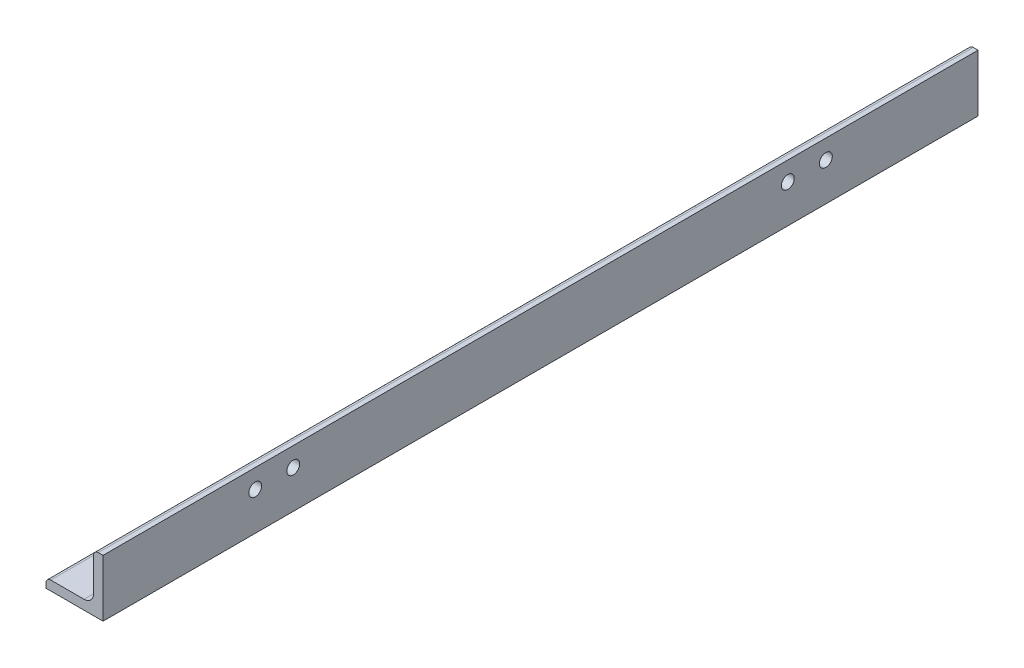
ISO-10303-21;
HEADER;
FILE_DESCRIPTION(('STEP AP214'),'2;1');
FILE_NAME('part.step','',(''),(''),'','','');
FILE_SCHEMA(('AUTOMOTIVE_DESIGN { 1 0 10303 214 1 1 1 1 }'));
ENDSEC;
DATA;
#1=APPLICATION_CONTEXT('core data for automotive mechanical design processes');
#2=APPLICATION_PROTOCOL_DEFINITION('international standard','automotive_design',2000,#1);
#3=PRODUCT_CONTEXT('',#1,'mechanical');
#4=PRODUCT('Part','Part','',(#3));
#5=PRODUCT_RELATED_PRODUCT_CATEGORY('part','',(#4));
#6=PRODUCT_DEFINITION_FORMATION('','',#4);
#7=PRODUCT_DEFINITION_CONTEXT('part definition',#1,'design');
#8=PRODUCT_DEFINITION('design','',#6,#7);
#9=PRODUCT_DEFINITION_SHAPE('','',#8);
#10=(LENGTH_UNIT() NAMED_UNIT(*) SI_UNIT(.MILLI.,.METRE.));
#11=(NAMED_UNIT(*) PLANE_ANGLE_UNIT() SI_UNIT($,.RADIAN.));
#12=(NAMED_UNIT(*) SI_UNIT($,.STERADIAN.) SOLID_ANGLE_UNIT());
#13=UNCERTAINTY_MEASURE_WITH_UNIT(LENGTH_MEASURE(1.E-05),#10,'distance_accuracy_value','');
#14=(GEOMETRIC_REPRESENTATION_CONTEXT(3) GLOBAL_UNCERTAINTY_ASSIGNED_CONTEXT((#13)) GLOBAL_UNIT_ASSIGNED_CONTEXT((#10,
#11,#12)) REPRESENTATION_CONTEXT('',''));
#15=CARTESIAN_POINT('',(0.,0.,0.));
#16=DIRECTION('',(0.,0.,1.));
#17=DIRECTION('',(1.,0.,0.));
#18=AXIS2_PLACEMENT_3D('',#15,#16,#17);
#19=CARTESIAN_POINT('',(3.17500000000001,-6.35,146.05));
#20=DIRECTION('',(0.,-1.,0.));
#21=DIRECTION('',(1.,0.,0.));
#22=AXIS2_PLACEMENT_3D('',#19,#20,#21);
#23=PLANE('',#22);
#24=CARTESIAN_POINT('',(-3.175,-6.35,-82.55));
#25=DIRECTION('',(0.,1.,0.));
#26=DIRECTION('',(0.,0.,1.));
#27=AXIS2_PLACEMENT_3D('',#24,#25,#26);
#28=CIRCLE('',#27,2.15264999999999);
#29=CARTESIAN_POINT('',(-3.175,-6.35,-80.39735));
#30=VERTEX_POINT('',#29);
#31=EDGE_CURVE('E228',#30,#30,#28,.T.);
#32=ORIENTED_EDGE('',*,*,#31,.F.);
#33=EDGE_LOOP('',(#32));
#34=FACE_BOUND('',#33,.T.);
#35=CARTESIAN_POINT('',(-3.17500000000001,-6.35,-95.25));
#36=DIRECTION('',(0.,1.,0.));
#37=DIRECTION('',(0.,0.,1.));
#38=AXIS2_PLACEMENT_3D('',#35,#36,#37);
#39=CIRCLE('',#38,2.15264999999999);
#40=CARTESIAN_POINT('',(-3.17500000000001,-6.35,-93.09735));
#41=VERTEX_POINT('',#40);
#42=EDGE_CURVE('E234',#41,#41,#39,.T.);
#43=ORIENTED_EDGE('',*,*,#42,.F.);
#44=EDGE_LOOP('',(#43));
#45=FACE_BOUND('',#44,.T.);
#46=CARTESIAN_POINT('',(-3.175,-6.35,82.55));
#47=DIRECTION('',(0.,1.,0.));
#48=DIRECTION('',(0.,0.,1.));
#49=AXIS2_PLACEMENT_3D('',#46,#47,#48);
#50=CIRCLE('',#49,2.15264999999999);
#51=CARTESIAN_POINT('',(-3.175,-6.35,84.70265));
#52=VERTEX_POINT('',#51);
#53=EDGE_CURVE('E240',#52,#52,#50,.T.);
#54=ORIENTED_EDGE('',*,*,#53,.F.);
#55=EDGE_LOOP('',(#54));
#56=FACE_BOUND('',#55,.T.);
#57=CARTESIAN_POINT('',(-3.17500000000001,-6.35,95.25));
#58=DIRECTION('',(0.,1.,0.));
#59=DIRECTION('',(0.,0.,1.));
#60=AXIS2_PLACEMENT_3D('',#57,#58,#59);
#61=CIRCLE('',#60,2.15264999999999);
#62=CARTESIAN_POINT('',(-3.17500000000001,-6.35,97.40265));
#63=VERTEX_POINT('',#62);
#64=EDGE_CURVE('E246',#63,#63,#61,.T.);
#65=ORIENTED_EDGE('',*,*,#64,.F.);
#66=EDGE_LOOP('',(#65));
#67=FACE_BOUND('',#66,.T.);
#68=CARTESIAN_POINT('',(1.58750000000001,-6.34999999999999,-134.9375));
#69=DIRECTION('',(0.,1.,0.));
#70=DIRECTION('',(0.,0.,1.));
#71=AXIS2_PLACEMENT_3D('',#68,#69,#70);
#72=CIRCLE('',#71,2.15264999999999);
#73=CARTESIAN_POINT('',(3.17500000000001,-6.35,-136.39137268098));
#74=VERTEX_POINT('',#73);
#75=CARTESIAN_POINT('',(3.17500000000001,-6.34999999999999,-133.48362731902));
#76=VERTEX_POINT('',#75);
#77=EDGE_CURVE('E264',#74,#76,#72,.T.);
#78=ORIENTED_EDGE('',*,*,#77,.F.);
#79=DIRECTION('',(0.,0.,-1.));
#80=VECTOR('',#79,1.);
#81=CARTESIAN_POINT('',(3.17500000000001,-6.35,146.05));
#82=LINE('',#81,#80);
#83=CARTESIAN_POINT('',(3.17500000000001,-6.35,-146.05));
#84=VERTEX_POINT('',#83);
#85=EDGE_CURVE('E147',#74,#84,#82,.T.);
#86=ORIENTED_EDGE('',*,*,#85,.T.);
#87=DIRECTION('',(-1.,0.,0.));
#88=VECTOR('',#87,1.);
#89=CARTESIAN_POINT('',(3.17500000000001,-6.35,-146.05));
#90=LINE('',#89,#88);
#91=CARTESIAN_POINT('',(-7.9375,-6.35,-146.05));
#92=VERTEX_POINT('',#91);
#93=EDGE_CURVE('E170',#84,#92,#90,.T.);
#94=ORIENTED_EDGE('',*,*,#93,.T.);
#95=DIRECTION('',(0.,0.,-1.));
#96=VECTOR('',#95,1.);
#97=CARTESIAN_POINT('',(-7.9375,-6.35,146.05));
#98=LINE('',#97,#96);
#99=CARTESIAN_POINT('',(-7.9375,-6.35,146.05));
#100=VERTEX_POINT('',#99);
#101=EDGE_CURVE('E148',#100,#92,#98,.T.);
#102=ORIENTED_EDGE('',*,*,#101,.F.);
#103=DIRECTION('',(-1.,0.,0.));
#104=VECTOR('',#103,1.);
#105=CARTESIAN_POINT('',(3.17500000000001,-6.35,146.05));
#106=LINE('',#105,#104);
#107=CARTESIAN_POINT('',(3.17500000000001,-6.35,146.05));
#108=VERTEX_POINT('',#107);
#109=EDGE_CURVE('E128',#108,#100,#106,.T.);
#110=ORIENTED_EDGE('',*,*,#109,.F.);
#111=EDGE_CURVE('E138',#108,#76,#82,.T.);
#112=ORIENTED_EDGE('',*,*,#111,.T.);
#113=EDGE_LOOP('',(#78,#86,#94,#102,#110,#112));
#114=FACE_BOUND('',#113,.T.);
#115=ADVANCED_FACE('F40',(#34,#45,#56,#67,#114),#23,.F.);
#116=CARTESIAN_POINT('',(-9.525,-7.9375,146.05));
#117=DIRECTION('',(1.,0.,0.));
#118=DIRECTION('',(0.,0.,-1.));
#119=AXIS2_PLACEMENT_3D('',#116,#117,#118);
#120=PLANE('',#119);
#121=DIRECTION('',(0.,-1.,0.));
#122=VECTOR('',#121,1.);
#123=CARTESIAN_POINT('',(-9.525,-7.9375,-146.05));
#124=LINE('',#123,#122);
#125=CARTESIAN_POINT('',(-9.525,-7.9375,-146.05));
#126=VERTEX_POINT('',#125);
#127=CARTESIAN_POINT('',(-9.525,-9.525,-146.05));
#128=VERTEX_POINT('',#127);
#129=EDGE_CURVE('E154',#126,#128,#124,.T.);
#130=ORIENTED_EDGE('',*,*,#129,.T.);
#131=DIRECTION('',(0.,0.,-1.));
#132=VECTOR('',#131,1.);
#133=CARTESIAN_POINT('',(-9.525,-9.525,146.05));
#134=LINE('',#133,#132);
#135=CARTESIAN_POINT('',(-9.525,-9.525,146.05));
#136=VERTEX_POINT('',#135);
#137=EDGE_CURVE('E11',#136,#128,#134,.T.);
#138=ORIENTED_EDGE('',*,*,#137,.F.);
#139=DIRECTION('',(0.,-1.,0.));
#140=VECTOR('',#139,1.);
#141=CARTESIAN_POINT('',(-9.525,-7.9375,146.05));
#142=LINE('',#141,#140);
#143=CARTESIAN_POINT('',(-9.525,-7.9375,146.05));
#144=VERTEX_POINT('',#143);
#145=EDGE_CURVE('E173',#144,#136,#142,.T.);
#146=ORIENTED_EDGE('',*,*,#145,.F.);
#147=DIRECTION('',(0.,0.,-1.));
#148=VECTOR('',#147,1.);
#149=CARTESIAN_POINT('',(-9.525,-7.9375,146.05));
#150=LINE('',#149,#148);
#151=EDGE_CURVE('E150',#144,#126,#150,.T.);
#152=ORIENTED_EDGE('',*,*,#151,.T.);
#153=EDGE_LOOP('',(#130,#138,#146,#152));
#154=FACE_BOUND('',#153,.T.);
#155=ADVANCED_FACE('F42',(#154),#120,.F.);
#156=CARTESIAN_POINT('',(-9.525,-9.525,146.05));
#157=DIRECTION('',(0.,1.,0.));
#158=DIRECTION('',(-1.,0.,0.));
#159=AXIS2_PLACEMENT_3D('',#156,#157,#158);
#160=PLANE('',#159);
#161=CARTESIAN_POINT('',(1.58750000000001,-9.52500000000001,-134.9375));
#162=DIRECTION('',(0.,1.,0.));
#163=DIRECTION('',(0.,0.,1.));
#164=AXIS2_PLACEMENT_3D('',#161,#162,#163);
#165=CIRCLE('',#164,2.15264999999999);
#166=CARTESIAN_POINT('',(1.58750000000001,-9.52500000000001,-132.78485));
#167=VERTEX_POINT('',#166);
#168=EDGE_CURVE('E261',#167,#167,#165,.T.);
#169=ORIENTED_EDGE('',*,*,#168,.T.);
#170=EDGE_LOOP('',(#169));
#171=FACE_BOUND('',#170,.T.);
#172=CARTESIAN_POINT('',(-3.17500000000001,-9.525,95.25));
#173=DIRECTION('',(0.,1.,0.));
#174=DIRECTION('',(0.,0.,1.));
#175=AXIS2_PLACEMENT_3D('',#172,#173,#174);
#176=CIRCLE('',#175,2.15265);
#177=CARTESIAN_POINT('',(-3.17500000000001,-9.525,97.40265));
#178=VERTEX_POINT('',#177);
#179=EDGE_CURVE('E243',#178,#178,#176,.T.);
#180=ORIENTED_EDGE('',*,*,#179,.T.);
#181=EDGE_LOOP('',(#180));
#182=FACE_BOUND('',#181,.T.);
#183=CARTESIAN_POINT('',(-3.175,-9.525,82.55));
#184=DIRECTION('',(0.,1.,0.));
#185=DIRECTION('',(0.,0.,1.));
#186=AXIS2_PLACEMENT_3D('',#183,#184,#185);
#187=CIRCLE('',#186,2.15265);
#188=CARTESIAN_POINT('',(-3.175,-9.525,84.70265));
#189=VERTEX_POINT('',#188);
#190=EDGE_CURVE('E237',#189,#189,#187,.T.);
#191=ORIENTED_EDGE('',*,*,#190,.T.);
#192=EDGE_LOOP('',(#191));
#193=FACE_BOUND('',#192,.T.);
#194=CARTESIAN_POINT('',(-3.17500000000001,-9.525,-95.25));
#195=DIRECTION('',(0.,1.,0.));
#196=DIRECTION('',(0.,0.,1.));
#197=AXIS2_PLACEMENT_3D('',#194,#195,#196);
#198=CIRCLE('',#197,2.15265);
#199=CARTESIAN_POINT('',(-3.17500000000001,-9.525,-93.09735));
#200=VERTEX_POINT('',#199);
#201=EDGE_CURVE('E231',#200,#200,#198,.T.);
#202=ORIENTED_EDGE('',*,*,#201,.T.);
#203=EDGE_LOOP('',(#202));
#204=FACE_BOUND('',#203,.T.);
#205=CARTESIAN_POINT('',(-3.175,-9.525,-82.55));
#206=DIRECTION('',(0.,1.,0.));
#207=DIRECTION('',(0.,0.,1.));
#208=AXIS2_PLACEMENT_3D('',#205,#206,#207);
#209=CIRCLE('',#208,2.15265);
#210=CARTESIAN_POINT('',(-3.175,-9.525,-80.39735));
#211=VERTEX_POINT('',#210);
#212=EDGE_CURVE('E225',#211,#211,#209,.T.);
#213=ORIENTED_EDGE('',*,*,#212,.T.);
#214=EDGE_LOOP('',(#213));
#215=FACE_BOUND('',#214,.T.);
#216=DIRECTION('',(1.,0.,0.));
#217=VECTOR('',#216,1.);
#218=CARTESIAN_POINT('',(-9.525,-9.525,-146.05));
#219=LINE('',#218,#217);
#220=CARTESIAN_POINT('',(9.525,-9.525,-146.05));
#221=VERTEX_POINT('',#220);
#222=EDGE_CURVE('E157',#128,#221,#219,.T.);
#223=ORIENTED_EDGE('',*,*,#222,.T.);
#224=DIRECTION('',(0.,0.,-1.));
#225=VECTOR('',#224,1.);
#226=CARTESIAN_POINT('',(9.525,-9.525,146.05));
#227=LINE('',#226,#225);
#228=CARTESIAN_POINT('',(9.525,-9.525,146.05));
#229=VERTEX_POINT('',#228);
#230=EDGE_CURVE('E48',#229,#221,#227,.T.);
#231=ORIENTED_EDGE('',*,*,#230,.F.);
#232=DIRECTION('',(1.,0.,0.));
#233=VECTOR('',#232,1.);
#234=CARTESIAN_POINT('',(-9.525,-9.525,146.05));
#235=LINE('',#234,#233);
#236=EDGE_CURVE('E107',#136,#229,#235,.T.);
#237=ORIENTED_EDGE('',*,*,#236,.F.);
#238=ORIENTED_EDGE('',*,*,#137,.T.);
#239=EDGE_LOOP('',(#223,#231,#237,#238));
#240=FACE_BOUND('',#239,.T.);
#241=ADVANCED_FACE('F293',(#171,#182,#193,#204,#215,#240),#160,.F.);
#242=CARTESIAN_POINT('',(9.525,-9.525,146.05));
#243=DIRECTION('',(-1.,0.,0.));
#244=DIRECTION('',(0.,-1.,0.));
#245=AXIS2_PLACEMENT_3D('',#242,#243,#244);
#246=PLANE('',#245);
#247=CARTESIAN_POINT('',(9.525,3.175,95.25));
#248=DIRECTION('',(-1.,0.,0.));
#249=DIRECTION('',(0.,0.,1.));
#250=AXIS2_PLACEMENT_3D('',#247,#248,#249);
#251=CIRCLE('',#250,2.15265);
#252=CARTESIAN_POINT('',(9.525,3.175,97.40265));
#253=VERTEX_POINT('',#252);
#254=EDGE_CURVE('E255',#253,#253,#251,.T.);
#255=ORIENTED_EDGE('',*,*,#254,.T.);
#256=EDGE_LOOP('',(#255));
#257=FACE_BOUND('',#256,.T.);
#258=CARTESIAN_POINT('',(9.525,3.175,82.55));
#259=DIRECTION('',(-1.,0.,0.));
#260=DIRECTION('',(0.,0.,1.));
#261=AXIS2_PLACEMENT_3D('',#258,#259,#260);
#262=CIRCLE('',#261,2.15265);
#263=CARTESIAN_POINT('',(9.525,3.175,84.70265));
#264=VERTEX_POINT('',#263);
#265=EDGE_CURVE('E249',#264,#264,#262,.T.);
#266=ORIENTED_EDGE('',*,*,#265,.T.);
#267=EDGE_LOOP('',(#266));
#268=FACE_BOUND('',#267,.T.);
#269=CARTESIAN_POINT('',(9.525,3.175,-95.25));
#270=DIRECTION('',(-1.,0.,0.));
#271=DIRECTION('',(0.,0.,1.));
#272=AXIS2_PLACEMENT_3D('',#269,#270,#271);
#273=CIRCLE('',#272,2.15265);
#274=CARTESIAN_POINT('',(9.525,3.175,-93.09735));
#275=VERTEX_POINT('',#274);
#276=EDGE_CURVE('E219',#275,#275,#273,.T.);
#277=ORIENTED_EDGE('',*,*,#276,.T.);
#278=EDGE_LOOP('',(#277));
#279=FACE_BOUND('',#278,.T.);
#280=CARTESIAN_POINT('',(9.525,3.175,-82.55));
#281=DIRECTION('',(-1.,0.,0.));
#282=DIRECTION('',(0.,0.,1.));
#283=AXIS2_PLACEMENT_3D('',#280,#281,#282);
#284=CIRCLE('',#283,2.15265);
#285=CARTESIAN_POINT('',(9.525,3.175,-80.39735));
#286=VERTEX_POINT('',#285);
#287=EDGE_CURVE('E158',#286,#286,#284,.T.);
#288=ORIENTED_EDGE('',*,*,#287,.T.);
#289=EDGE_LOOP('',(#288));
#290=FACE_BOUND('',#289,.T.);
#291=DIRECTION('',(0.,1.,0.));
#292=VECTOR('',#291,1.);
#293=CARTESIAN_POINT('',(9.525,-9.525,-146.05));
#294=LINE('',#293,#292);
#295=CARTESIAN_POINT('',(9.525,9.525,-146.05));
#296=VERTEX_POINT('',#295);
#297=EDGE_CURVE('E160',#221,#296,#294,.T.);
#298=ORIENTED_EDGE('',*,*,#297,.T.);
#299=DIRECTION('',(0.,0.,-1.));
#300=VECTOR('',#299,1.);
#301=CARTESIAN_POINT('',(9.525,9.525,146.05));
#302=LINE('',#301,#300);
#303=CARTESIAN_POINT('',(9.525,9.525,146.05));
#304=VERTEX_POINT('',#303);
#305=EDGE_CURVE('E183',#304,#296,#302,.T.);
#306=ORIENTED_EDGE('',*,*,#305,.F.);
#307=DIRECTION('',(0.,1.,0.));
#308=VECTOR('',#307,1.);
#309=CARTESIAN_POINT('',(9.525,-9.525,146.05));
#310=LINE('',#309,#308);
#311=EDGE_CURVE('E191',#229,#304,#310,.T.);
#312=ORIENTED_EDGE('',*,*,#311,.F.);
#313=ORIENTED_EDGE('',*,*,#230,.T.);
#314=EDGE_LOOP('',(#298,#306,#312,#313));
#315=FACE_BOUND('',#314,.T.);
#316=ADVANCED_FACE('F189',(#257,#268,#279,#290,#315),#246,.F.);
#317=CARTESIAN_POINT('',(7.9375,9.525,146.05));
#318=DIRECTION('',(0.,-1.,0.));
#319=DIRECTION('',(1.,0.,0.));
#320=AXIS2_PLACEMENT_3D('',#317,#318,#319);
#321=PLANE('',#320);
#322=DIRECTION('',(-1.,0.,0.));
#323=VECTOR('',#322,1.);
#324=CARTESIAN_POINT('',(7.9375,9.525,-146.05));
#325=LINE('',#324,#323);
#326=CARTESIAN_POINT('',(7.9375,9.525,-146.05));
#327=VERTEX_POINT('',#326);
#328=EDGE_CURVE('E162',#296,#327,#325,.T.);
#329=ORIENTED_EDGE('',*,*,#328,.T.);
#330=DIRECTION('',(0.,0.,-1.));
#331=VECTOR('',#330,1.);
#332=CARTESIAN_POINT('',(7.9375,9.525,146.05));
#333=LINE('',#332,#331);
#334=CARTESIAN_POINT('',(7.9375,9.525,146.05));
#335=VERTEX_POINT('',#334);
#336=EDGE_CURVE('E180',#335,#327,#333,.T.);
#337=ORIENTED_EDGE('',*,*,#336,.F.);
#338=DIRECTION('',(-1.,0.,0.));
#339=VECTOR('',#338,1.);
#340=CARTESIAN_POINT('',(7.9375,9.525,146.05));
#341=LINE('',#340,#339);
#342=EDGE_CURVE('E207',#304,#335,#341,.T.);
#343=ORIENTED_EDGE('',*,*,#342,.F.);
#344=ORIENTED_EDGE('',*,*,#305,.T.);
#345=EDGE_LOOP('',(#329,#337,#343,#344));
#346=FACE_BOUND('',#345,.T.);
#347=ADVANCED_FACE('F200',(#346),#321,.F.);
#348=CARTESIAN_POINT('',(7.9375,7.9375,146.05));
#349=DIRECTION('',(0.,0.,-1.));
#350=DIRECTION('',(-1.,0.,0.));
#351=AXIS2_PLACEMENT_3D('',#348,#349,#350);
#352=CYLINDRICAL_SURFACE('',#351,1.5875);
#353=CARTESIAN_POINT('',(7.9375,7.9375,-146.05));
#354=DIRECTION('',(0.,0.,1.));
#355=DIRECTION('',(-1.,0.,0.));
#356=AXIS2_PLACEMENT_3D('',#353,#354,#355);
#357=CIRCLE('',#356,1.5875);
#358=CARTESIAN_POINT('',(6.35,7.9375,-146.05));
#359=VERTEX_POINT('',#358);
#360=EDGE_CURVE('E164',#327,#359,#357,.T.);
#361=ORIENTED_EDGE('',*,*,#360,.T.);
#362=DIRECTION('',(0.,0.,-1.));
#363=VECTOR('',#362,1.);
#364=CARTESIAN_POINT('',(6.35,7.9375,146.05));
#365=LINE('',#364,#363);
#366=CARTESIAN_POINT('',(6.35,7.9375,146.05));
#367=VERTEX_POINT('',#366);
#368=EDGE_CURVE('E177',#367,#359,#365,.T.);
#369=ORIENTED_EDGE('',*,*,#368,.F.);
#370=CARTESIAN_POINT('',(7.9375,7.9375,146.05));
#371=DIRECTION('',(0.,0.,1.));
#372=DIRECTION('',(-1.,0.,0.));
#373=AXIS2_PLACEMENT_3D('',#370,#371,#372);
#374=CIRCLE('',#373,1.5875);
#375=EDGE_CURVE('E206',#335,#367,#374,.T.);
#376=ORIENTED_EDGE('',*,*,#375,.F.);
#377=ORIENTED_EDGE('',*,*,#336,.T.);
#378=EDGE_LOOP('',(#361,#369,#376,#377));
#379=FACE_BOUND('',#378,.T.);
#380=ADVANCED_FACE('F204',(#379),#352,.T.);
#381=CARTESIAN_POINT('',(6.35,7.9375,146.05));
#382=DIRECTION('',(1.,0.,0.));
#383=DIRECTION('',(0.,1.,0.));
#384=AXIS2_PLACEMENT_3D('',#381,#382,#383);
#385=PLANE('',#384);
#386=CARTESIAN_POINT('',(6.35,3.175,95.25));
#387=DIRECTION('',(-1.,0.,0.));
#388=DIRECTION('',(0.,0.,1.));
#389=AXIS2_PLACEMENT_3D('',#386,#387,#388);
#390=CIRCLE('',#389,2.15264999999999);
#391=CARTESIAN_POINT('',(6.35,3.175,97.40265));
#392=VERTEX_POINT('',#391);
#393=EDGE_CURVE('E258',#392,#392,#390,.T.);
#394=ORIENTED_EDGE('',*,*,#393,.F.);
#395=EDGE_LOOP('',(#394));
#396=FACE_BOUND('',#395,.T.);
#397=CARTESIAN_POINT('',(6.35,3.175,82.55));
#398=DIRECTION('',(-1.,0.,0.));
#399=DIRECTION('',(0.,0.,1.));
#400=AXIS2_PLACEMENT_3D('',#397,#398,#399);
#401=CIRCLE('',#400,2.15264999999999);
#402=CARTESIAN_POINT('',(6.35,3.175,84.70265));
#403=VERTEX_POINT('',#402);
#404=EDGE_CURVE('E252',#403,#403,#401,.T.);
#405=ORIENTED_EDGE('',*,*,#404,.F.);
#406=EDGE_LOOP('',(#405));
#407=FACE_BOUND('',#406,.T.);
#408=CARTESIAN_POINT('',(6.35,3.175,-95.25));
#409=DIRECTION('',(-1.,0.,0.));
#410=DIRECTION('',(0.,0.,1.));
#411=AXIS2_PLACEMENT_3D('',#408,#409,#410);
#412=CIRCLE('',#411,2.15264999999999);
#413=CARTESIAN_POINT('',(6.35,3.175,-93.09735));
#414=VERTEX_POINT('',#413);
#415=EDGE_CURVE('E222',#414,#414,#412,.T.);
#416=ORIENTED_EDGE('',*,*,#415,.F.);
#417=EDGE_LOOP('',(#416));
#418=FACE_BOUND('',#417,.T.);
#419=CARTESIAN_POINT('',(6.35,3.175,-82.55));
#420=DIRECTION('',(-1.,0.,0.));
#421=DIRECTION('',(0.,0.,1.));
#422=AXIS2_PLACEMENT_3D('',#419,#420,#421);
#423=CIRCLE('',#422,2.15264999999999);
#424=CARTESIAN_POINT('',(6.35,3.175,-80.39735));
#425=VERTEX_POINT('',#424);
#426=EDGE_CURVE('E216',#425,#425,#423,.T.);
#427=ORIENTED_EDGE('',*,*,#426,.F.);
#428=EDGE_LOOP('',(#427));
#429=FACE_BOUND('',#428,.T.);
#430=DIRECTION('',(0.,-1.,0.));
#431=VECTOR('',#430,1.);
#432=CARTESIAN_POINT('',(6.35,7.9375,-146.05));
#433=LINE('',#432,#431);
#434=CARTESIAN_POINT('',(6.35,-3.175,-146.05));
#435=VERTEX_POINT('',#434);
#436=EDGE_CURVE('E166',#359,#435,#433,.T.);
#437=ORIENTED_EDGE('',*,*,#436,.T.);
#438=DIRECTION('',(0.,0.,-1.));
#439=VECTOR('',#438,1.);
#440=CARTESIAN_POINT('',(6.35,-3.175,146.05));
#441=LINE('',#440,#439);
#442=CARTESIAN_POINT('',(6.35,-3.175,146.05));
#443=VERTEX_POINT('',#442);
#444=EDGE_CURVE('E145',#443,#435,#441,.T.);
#445=ORIENTED_EDGE('',*,*,#444,.F.);
#446=DIRECTION('',(0.,-1.,0.));
#447=VECTOR('',#446,1.);
#448=CARTESIAN_POINT('',(6.35,7.9375,146.05));
#449=LINE('',#448,#447);
#450=EDGE_CURVE('E131',#367,#443,#449,.T.);
#451=ORIENTED_EDGE('',*,*,#450,.F.);
#452=ORIENTED_EDGE('',*,*,#368,.T.);
#453=EDGE_LOOP('',(#437,#445,#451,#452));
#454=FACE_BOUND('',#453,.T.);
#455=ADVANCED_FACE('F282',(#396,#407,#418,#429,#454),#385,.F.);
#456=CARTESIAN_POINT('',(3.17500000000001,-3.175,146.05));
#457=DIRECTION('',(0.,0.,-1.));
#458=DIRECTION('',(-1.,0.,0.));
#459=AXIS2_PLACEMENT_3D('',#456,#457,#458);
#460=CYLINDRICAL_SURFACE('',#459,3.175);
#461=CARTESIAN_POINT('',(3.17500000000001,-3.175,-146.05));
#462=DIRECTION('',(0.,0.,-1.));
#463=DIRECTION('',(-1.,0.,0.));
#464=AXIS2_PLACEMENT_3D('',#461,#462,#463);
#465=CIRCLE('',#464,3.175);
#466=EDGE_CURVE('E168',#435,#84,#465,.T.);
#467=ORIENTED_EDGE('',*,*,#466,.T.);
#468=ORIENTED_EDGE('',*,*,#85,.F.);
#469=EDGE_CURVE('E142',#76,#74,#82,.T.);
#470=ORIENTED_EDGE('',*,*,#469,.F.);
#471=ORIENTED_EDGE('',*,*,#111,.F.);
#472=CARTESIAN_POINT('',(3.17500000000001,-3.175,146.05));
#473=DIRECTION('',(0.,0.,-1.));
#474=DIRECTION('',(-1.,0.,0.));
#475=AXIS2_PLACEMENT_3D('',#472,#473,#474);
#476=CIRCLE('',#475,3.175);
#477=EDGE_CURVE('E124',#443,#108,#476,.T.);
#478=ORIENTED_EDGE('',*,*,#477,.F.);
#479=ORIENTED_EDGE('',*,*,#444,.T.);
#480=EDGE_LOOP('',(#467,#468,#470,#471,#478,#479));
#481=FACE_BOUND('',#480,.T.);
#482=ADVANCED_FACE('F140',(#481),#460,.F.);
#483=CARTESIAN_POINT('',(-7.9375,-7.9375,146.05));
#484=DIRECTION('',(0.,0.,-1.));
#485=DIRECTION('',(-1.,0.,0.));
#486=AXIS2_PLACEMENT_3D('',#483,#484,#485);
#487=CYLINDRICAL_SURFACE('',#486,1.5875);
#488=CARTESIAN_POINT('',(-7.9375,-7.9375,-146.05));
#489=DIRECTION('',(0.,0.,1.));
#490=DIRECTION('',(-1.,0.,0.));
#491=AXIS2_PLACEMENT_3D('',#488,#489,#490);
#492=CIRCLE('',#491,1.5875);
#493=EDGE_CURVE('E99',#92,#126,#492,.T.);
#494=ORIENTED_EDGE('',*,*,#493,.T.);
#495=ORIENTED_EDGE('',*,*,#151,.F.);
#496=CARTESIAN_POINT('',(-7.9375,-7.9375,146.05));
#497=DIRECTION('',(0.,0.,1.));
#498=DIRECTION('',(-1.,0.,0.));
#499=AXIS2_PLACEMENT_3D('',#496,#497,#498);
#500=CIRCLE('',#499,1.5875);
#501=EDGE_CURVE('E63',#100,#144,#500,.T.);
#502=ORIENTED_EDGE('',*,*,#501,.F.);
#503=ORIENTED_EDGE('',*,*,#101,.T.);
#504=EDGE_LOOP('',(#494,#495,#502,#503));
#505=FACE_BOUND('',#504,.T.);
#506=ADVANCED_FACE('F273',(#505),#487,.T.);
#507=CARTESIAN_POINT('',(7.9375,7.9375,146.05));
#508=DIRECTION('',(0.,0.,-1.));
#509=DIRECTION('',(-1.,0.,0.));
#510=AXIS2_PLACEMENT_3D('',#507,#508,#509);
#511=PLANE('',#510);
#512=ORIENTED_EDGE('',*,*,#145,.T.);
#513=ORIENTED_EDGE('',*,*,#236,.T.);
#514=ORIENTED_EDGE('',*,*,#311,.T.);
#515=ORIENTED_EDGE('',*,*,#342,.T.);
#516=ORIENTED_EDGE('',*,*,#375,.T.);
#517=ORIENTED_EDGE('',*,*,#450,.T.);
#518=ORIENTED_EDGE('',*,*,#477,.T.);
#519=ORIENTED_EDGE('',*,*,#109,.T.);
#520=ORIENTED_EDGE('',*,*,#501,.T.);
#521=EDGE_LOOP('',(#512,#513,#514,#515,#516,#517,#518,#519,#520));
#522=FACE_BOUND('',#521,.T.);
#523=ADVANCED_FACE('F126',(#522),#511,.F.);
#524=CARTESIAN_POINT('',(7.9375,7.9375,-146.05));
#525=DIRECTION('',(0.,0.,-1.));
#526=DIRECTION('',(-1.,0.,0.));
#527=AXIS2_PLACEMENT_3D('',#524,#525,#526);
#528=PLANE('',#527);
#529=ORIENTED_EDGE('',*,*,#129,.F.);
#530=ORIENTED_EDGE('',*,*,#493,.F.);
#531=ORIENTED_EDGE('',*,*,#93,.F.);
#532=ORIENTED_EDGE('',*,*,#466,.F.);
#533=ORIENTED_EDGE('',*,*,#436,.F.);
#534=ORIENTED_EDGE('',*,*,#360,.F.);
#535=ORIENTED_EDGE('',*,*,#328,.F.);
#536=ORIENTED_EDGE('',*,*,#297,.F.);
#537=ORIENTED_EDGE('',*,*,#222,.F.);
#538=EDGE_LOOP('',(#529,#530,#531,#532,#533,#534,#535,#536,#537));
#539=FACE_BOUND('',#538,.T.);
#540=ADVANCED_FACE('F195',(#539),#528,.T.);
#541=CARTESIAN_POINT('',(6.35,3.175,-82.55));
#542=DIRECTION('',(-1.,0.,0.));
#543=DIRECTION('',(0.,0.,1.));
#544=AXIS2_PLACEMENT_3D('',#541,#542,#543);
#545=CYLINDRICAL_SURFACE('',#544,2.15264999999999);
#546=ORIENTED_EDGE('',*,*,#287,.F.);
#547=EDGE_LOOP('',(#546));
#548=FACE_BOUND('',#547,.T.);
#549=ORIENTED_EDGE('',*,*,#426,.T.);
#550=EDGE_LOOP('',(#549));
#551=FACE_BOUND('',#550,.T.);
#552=ADVANCED_FACE('F332',(#548,#551),#545,.F.);
#553=CARTESIAN_POINT('',(6.35,3.175,-95.25));
#554=DIRECTION('',(-1.,0.,0.));
#555=DIRECTION('',(0.,0.,1.));
#556=AXIS2_PLACEMENT_3D('',#553,#554,#555);
#557=CYLINDRICAL_SURFACE('',#556,2.15264999999999);
#558=ORIENTED_EDGE('',*,*,#276,.F.);
#559=EDGE_LOOP('',(#558));
#560=FACE_BOUND('',#559,.T.);
#561=ORIENTED_EDGE('',*,*,#415,.T.);
#562=EDGE_LOOP('',(#561));
#563=FACE_BOUND('',#562,.T.);
#564=ADVANCED_FACE('F323',(#560,#563),#557,.F.);
#565=CARTESIAN_POINT('',(-3.175,-6.35,-82.55));
#566=DIRECTION('',(0.,1.,0.));
#567=DIRECTION('',(0.,0.,1.));
#568=AXIS2_PLACEMENT_3D('',#565,#566,#567);
#569=CYLINDRICAL_SURFACE('',#568,2.15264999999999);
#570=ORIENTED_EDGE('',*,*,#212,.F.);
#571=EDGE_LOOP('',(#570));
#572=FACE_BOUND('',#571,.T.);
#573=ORIENTED_EDGE('',*,*,#31,.T.);
#574=EDGE_LOOP('',(#573));
#575=FACE_BOUND('',#574,.T.);
#576=ADVANCED_FACE('F319',(#572,#575),#569,.F.);
#577=CARTESIAN_POINT('',(-3.17500000000001,-6.35,-95.25));
#578=DIRECTION('',(0.,1.,0.));
#579=DIRECTION('',(0.,0.,1.));
#580=AXIS2_PLACEMENT_3D('',#577,#578,#579);
#581=CYLINDRICAL_SURFACE('',#580,2.15264999999999);
#582=ORIENTED_EDGE('',*,*,#201,.F.);
#583=EDGE_LOOP('',(#582));
#584=FACE_BOUND('',#583,.T.);
#585=ORIENTED_EDGE('',*,*,#42,.T.);
#586=EDGE_LOOP('',(#585));
#587=FACE_BOUND('',#586,.T.);
#588=ADVANCED_FACE('F322',(#584,#587),#581,.F.);
#589=CARTESIAN_POINT('',(-3.175,-6.35,82.55));
#590=DIRECTION('',(0.,1.,0.));
#591=DIRECTION('',(0.,0.,1.));
#592=AXIS2_PLACEMENT_3D('',#589,#590,#591);
#593=CYLINDRICAL_SURFACE('',#592,2.15264999999999);
#594=ORIENTED_EDGE('',*,*,#190,.F.);
#595=EDGE_LOOP('',(#594));
#596=FACE_BOUND('',#595,.T.);
#597=ORIENTED_EDGE('',*,*,#53,.T.);
#598=EDGE_LOOP('',(#597));
#599=FACE_BOUND('',#598,.T.);
#600=ADVANCED_FACE('F329',(#596,#599),#593,.F.);
#601=CARTESIAN_POINT('',(-3.17500000000001,-6.35,95.25));
#602=DIRECTION('',(0.,1.,0.));
#603=DIRECTION('',(0.,0.,1.));
#604=AXIS2_PLACEMENT_3D('',#601,#602,#603);
#605=CYLINDRICAL_SURFACE('',#604,2.15264999999999);
#606=ORIENTED_EDGE('',*,*,#179,.F.);
#607=EDGE_LOOP('',(#606));
#608=FACE_BOUND('',#607,.T.);
#609=ORIENTED_EDGE('',*,*,#64,.T.);
#610=EDGE_LOOP('',(#609));
#611=FACE_BOUND('',#610,.T.);
#612=ADVANCED_FACE('F387',(#608,#611),#605,.F.);
#613=CARTESIAN_POINT('',(6.35,3.175,82.55));
#614=DIRECTION('',(-1.,0.,0.));
#615=DIRECTION('',(0.,0.,1.));
#616=AXIS2_PLACEMENT_3D('',#613,#614,#615);
#617=CYLINDRICAL_SURFACE('',#616,2.15264999999999);
#618=ORIENTED_EDGE('',*,*,#265,.F.);
#619=EDGE_LOOP('',(#618));
#620=FACE_BOUND('',#619,.T.);
#621=ORIENTED_EDGE('',*,*,#404,.T.);
#622=EDGE_LOOP('',(#621));
#623=FACE_BOUND('',#622,.T.);
#624=ADVANCED_FACE('F396',(#620,#623),#617,.F.);
#625=CARTESIAN_POINT('',(6.35,3.175,95.25));
#626=DIRECTION('',(-1.,0.,0.));
#627=DIRECTION('',(0.,0.,1.));
#628=AXIS2_PLACEMENT_3D('',#625,#626,#627);
#629=CYLINDRICAL_SURFACE('',#628,2.15264999999999);
#630=ORIENTED_EDGE('',*,*,#254,.F.);
#631=EDGE_LOOP('',(#630));
#632=FACE_BOUND('',#631,.T.);
#633=ORIENTED_EDGE('',*,*,#393,.T.);
#634=EDGE_LOOP('',(#633));
#635=FACE_BOUND('',#634,.T.);
#636=ADVANCED_FACE('F405',(#632,#635),#629,.F.);
#637=CARTESIAN_POINT('',(3.74015,-6.34999999999999,-134.9375));
#638=DIRECTION('',(0.,1.,0.));
#639=DIRECTION('',(0.,0.,1.));
#640=AXIS2_PLACEMENT_3D('',#637,#638,#639);
#641=PLANE('',#640);
#642=EDGE_CURVE('E54',#76,#74,#72,.T.);
#643=ORIENTED_EDGE('',*,*,#642,.F.);
#644=ORIENTED_EDGE('',*,*,#469,.T.);
#645=EDGE_LOOP('',(#643,#644));
#646=FACE_BOUND('',#645,.T.);
#647=ADVANCED_FACE('F267',(#646),#641,.F.);
#648=CARTESIAN_POINT('',(1.58750000000001,-6.34999999999999,-134.9375));
#649=DIRECTION('',(0.,1.,0.));
#650=DIRECTION('',(0.,0.,1.));
#651=AXIS2_PLACEMENT_3D('',#648,#649,#650);
#652=CYLINDRICAL_SURFACE('',#651,2.15264999999999);
#653=ORIENTED_EDGE('',*,*,#168,.F.);
#654=EDGE_LOOP('',(#653));
#655=FACE_BOUND('',#654,.T.);
#656=ORIENTED_EDGE('',*,*,#642,.T.);
#657=ORIENTED_EDGE('',*,*,#77,.T.);
#658=EDGE_LOOP('',(#656,#657));
#659=FACE_BOUND('',#658,.T.);
#660=ADVANCED_FACE('F265',(#655,#659),#652,.F.);
#661=CLOSED_SHELL('',(#115,#155,#241,#316,#347,#380,#455,#482,#506,#523,#540,#552,#564,#576,
#588,#600,#612,#624,#636,#647,#660));
#662=MANIFOLD_SOLID_BREP('B2',#661);
#663=ADVANCED_BREP_SHAPE_REPRESENTATION('',(#18,#662),#14);
#664=SHAPE_DEFINITION_REPRESENTATION(#9,#663);
ENDSEC;
END-ISO-10303-21;
